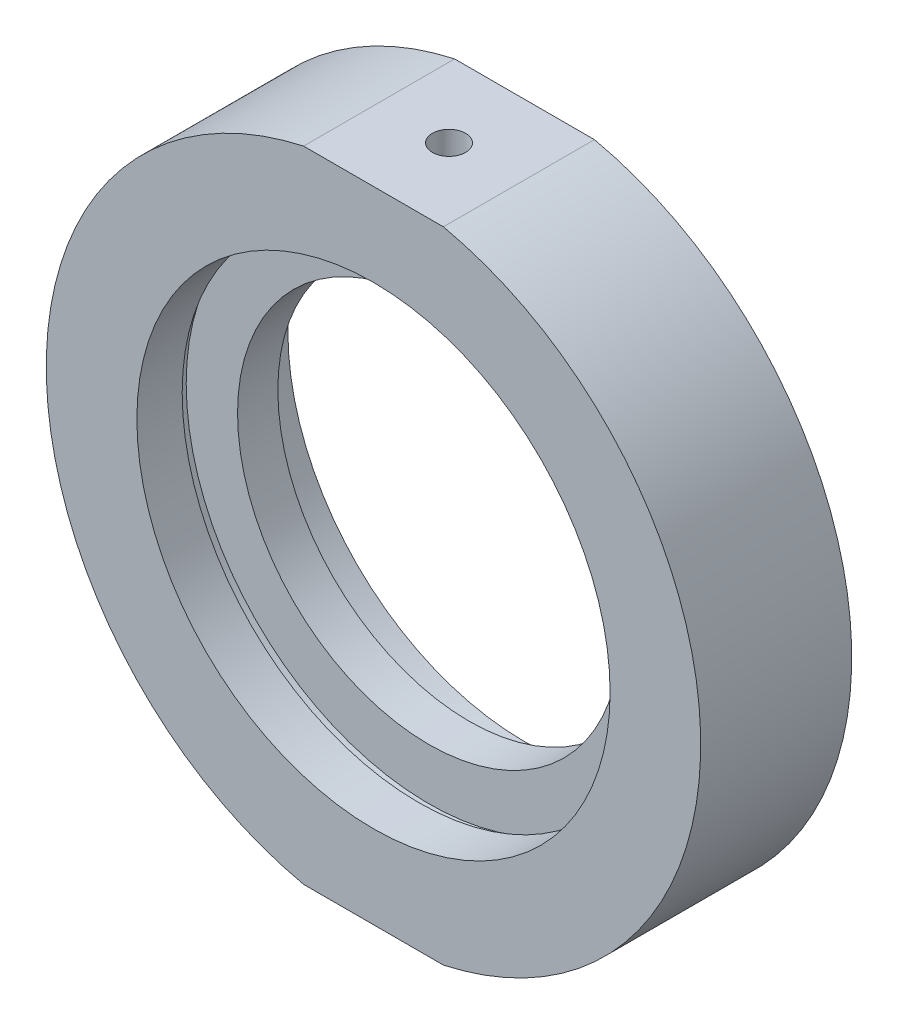
ISO-10303-21;
HEADER;
FILE_DESCRIPTION(('STEP AP214'),'2;1');
FILE_NAME('part.step','',(''),(''),'','','');
FILE_SCHEMA(('AUTOMOTIVE_DESIGN { 1 0 10303 214 1 1 1 1 }'));
ENDSEC;
DATA;
#1=APPLICATION_CONTEXT('core data for automotive mechanical design processes');
#2=APPLICATION_PROTOCOL_DEFINITION('international standard','automotive_design',2000,#1);
#3=PRODUCT_CONTEXT('',#1,'mechanical');
#4=PRODUCT('Part','Part','',(#3));
#5=PRODUCT_RELATED_PRODUCT_CATEGORY('part','',(#4));
#6=PRODUCT_DEFINITION_FORMATION('','',#4);
#7=PRODUCT_DEFINITION_CONTEXT('part definition',#1,'design');
#8=PRODUCT_DEFINITION('design','',#6,#7);
#9=PRODUCT_DEFINITION_SHAPE('','',#8);
#10=(LENGTH_UNIT() NAMED_UNIT(*) SI_UNIT(.MILLI.,.METRE.));
#11=(NAMED_UNIT(*) PLANE_ANGLE_UNIT() SI_UNIT($,.RADIAN.));
#12=(NAMED_UNIT(*) SI_UNIT($,.STERADIAN.) SOLID_ANGLE_UNIT());
#13=UNCERTAINTY_MEASURE_WITH_UNIT(LENGTH_MEASURE(1.E-05),#10,'distance_accuracy_value','');
#14=(GEOMETRIC_REPRESENTATION_CONTEXT(3) GLOBAL_UNCERTAINTY_ASSIGNED_CONTEXT((#13)) GLOBAL_UNIT_ASSIGNED_CONTEXT((#10,
#11,#12)) REPRESENTATION_CONTEXT('',''));
#15=CARTESIAN_POINT('',(0.,0.,0.));
#16=DIRECTION('',(0.,0.,1.));
#17=DIRECTION('',(1.,0.,0.));
#18=AXIS2_PLACEMENT_3D('',#15,#16,#17);
#19=CARTESIAN_POINT('',(0.,0.,-31.9390681003584));
#20=DIRECTION('',(0.,0.,-1.));
#21=DIRECTION('',(-1.,0.,0.));
#22=AXIS2_PLACEMENT_3D('',#19,#20,#21);
#23=CYLINDRICAL_SURFACE('',#22,32.5);
#24=CARTESIAN_POINT('',(0.,0.,7.50000000000001));
#25=DIRECTION('',(0.,0.,-1.));
#26=DIRECTION('',(-1.,0.,0.));
#27=AXIS2_PLACEMENT_3D('',#24,#25,#26);
#28=CIRCLE('',#27,32.5);
#29=CARTESIAN_POINT('',(6.94172168845742,31.75,7.5));
#30=VERTEX_POINT('',#29);
#31=CARTESIAN_POINT('',(6.94172168845742,-31.75,7.5));
#32=VERTEX_POINT('',#31);
#33=EDGE_CURVE('E153',#30,#32,#28,.T.);
#34=ORIENTED_EDGE('',*,*,#33,.T.);
#35=DIRECTION('',(0.,0.,-1.));
#36=VECTOR('',#35,1.);
#37=CARTESIAN_POINT('',(6.94172168845748,-31.75,-31.9390681003584));
#38=LINE('',#37,#36);
#39=CARTESIAN_POINT('',(6.94172168845745,-31.75,-7.5));
#40=VERTEX_POINT('',#39);
#41=EDGE_CURVE('E118',#32,#40,#38,.T.);
#42=ORIENTED_EDGE('',*,*,#41,.T.);
#43=CARTESIAN_POINT('',(0.,0.,-7.5));
#44=DIRECTION('',(0.,0.,-1.));
#45=DIRECTION('',(-1.,0.,0.));
#46=AXIS2_PLACEMENT_3D('',#43,#44,#45);
#47=CIRCLE('',#46,32.5);
#48=CARTESIAN_POINT('',(6.94172168845745,31.75,-7.5));
#49=VERTEX_POINT('',#48);
#50=EDGE_CURVE('E148',#49,#40,#47,.T.);
#51=ORIENTED_EDGE('',*,*,#50,.F.);
#52=DIRECTION('',(0.,0.,-1.));
#53=VECTOR('',#52,1.);
#54=CARTESIAN_POINT('',(6.94172168845748,31.75,-31.9390681003584));
#55=LINE('',#54,#53);
#56=EDGE_CURVE('E64',#49,#30,#55,.F.);
#57=ORIENTED_EDGE('',*,*,#56,.T.);
#58=EDGE_LOOP('',(#34,#42,#51,#57));
#59=FACE_BOUND('',#58,.T.);
#60=ADVANCED_FACE('F41',(#59),#23,.T.);
#61=CARTESIAN_POINT('',(19.,0.,-2.));
#62=DIRECTION('',(0.,0.,1.));
#63=DIRECTION('',(1.,0.,0.));
#64=AXIS2_PLACEMENT_3D('',#61,#62,#63);
#65=PLANE('',#64);
#66=CARTESIAN_POINT('',(0.,0.,-2.));
#67=DIRECTION('',(0.,0.,-1.));
#68=DIRECTION('',(-1.,0.,0.));
#69=AXIS2_PLACEMENT_3D('',#66,#67,#68);
#70=CIRCLE('',#69,19.);
#71=CARTESIAN_POINT('',(-19.,0.,-2.));
#72=VERTEX_POINT('',#71);
#73=EDGE_CURVE('E176',#72,#72,#70,.T.);
#74=ORIENTED_EDGE('',*,*,#73,.F.);
#75=EDGE_LOOP('',(#74));
#76=FACE_BOUND('',#75,.T.);
#77=CARTESIAN_POINT('',(0.,0.,-2.));
#78=DIRECTION('',(0.,0.,-1.));
#79=DIRECTION('',(-1.,0.,0.));
#80=AXIS2_PLACEMENT_3D('',#77,#78,#79);
#81=CIRCLE('',#80,24.1);
#82=CARTESIAN_POINT('',(-24.1,0.,-2.));
#83=VERTEX_POINT('',#82);
#84=EDGE_CURVE('E131',#83,#83,#81,.T.);
#85=ORIENTED_EDGE('',*,*,#84,.T.);
#86=EDGE_LOOP('',(#85));
#87=FACE_BOUND('',#86,.T.);
#88=ADVANCED_FACE('F43',(#76,#87),#65,.F.);
#89=CARTESIAN_POINT('',(0.,0.,-31.9390681003584));
#90=DIRECTION('',(0.,0.,-1.));
#91=DIRECTION('',(-1.,0.,0.));
#92=AXIS2_PLACEMENT_3D('',#89,#90,#91);
#93=CYLINDRICAL_SURFACE('',#92,19.);
#94=CARTESIAN_POINT('',(0.,0.,2.));
#95=DIRECTION('',(0.,0.,-1.));
#96=DIRECTION('',(-1.,0.,0.));
#97=AXIS2_PLACEMENT_3D('',#94,#95,#96);
#98=CIRCLE('',#97,19.);
#99=CARTESIAN_POINT('',(-19.,0.,2.));
#100=VERTEX_POINT('',#99);
#101=EDGE_CURVE('E172',#100,#100,#98,.T.);
#102=ORIENTED_EDGE('',*,*,#101,.F.);
#103=EDGE_LOOP('',(#102));
#104=FACE_BOUND('',#103,.T.);
#105=ORIENTED_EDGE('',*,*,#73,.T.);
#106=EDGE_LOOP('',(#105));
#107=FACE_BOUND('',#106,.T.);
#108=ADVANCED_FACE('F219',(#104,#107),#93,.F.);
#109=CARTESIAN_POINT('',(24.1,0.,2.));
#110=DIRECTION('',(0.,0.,-1.));
#111=DIRECTION('',(-1.,0.,0.));
#112=AXIS2_PLACEMENT_3D('',#109,#110,#111);
#113=PLANE('',#112);
#114=CARTESIAN_POINT('',(0.,0.,1.99999999999999));
#115=DIRECTION('',(0.,0.,-1.));
#116=DIRECTION('',(-1.,0.,0.));
#117=AXIS2_PLACEMENT_3D('',#114,#115,#116);
#118=CIRCLE('',#117,24.1);
#119=CARTESIAN_POINT('',(-24.1,0.,2.));
#120=VERTEX_POINT('',#119);
#121=EDGE_CURVE('E168',#120,#120,#118,.T.);
#122=ORIENTED_EDGE('',*,*,#121,.F.);
#123=EDGE_LOOP('',(#122));
#124=FACE_BOUND('',#123,.T.);
#125=ORIENTED_EDGE('',*,*,#101,.T.);
#126=EDGE_LOOP('',(#125));
#127=FACE_BOUND('',#126,.T.);
#128=ADVANCED_FACE('F244',(#124,#127),#113,.F.);
#129=CARTESIAN_POINT('',(0.,0.,-31.9390681003584));
#130=DIRECTION('',(0.,0.,-1.));
#131=DIRECTION('',(-1.,0.,0.));
#132=AXIS2_PLACEMENT_3D('',#129,#130,#131);
#133=CYLINDRICAL_SURFACE('',#132,24.1);
#134=CARTESIAN_POINT('',(0.,0.,3.));
#135=DIRECTION('',(0.,0.,-1.));
#136=DIRECTION('',(-1.,0.,0.));
#137=AXIS2_PLACEMENT_3D('',#134,#135,#136);
#138=CIRCLE('',#137,24.1);
#139=CARTESIAN_POINT('',(-24.1,0.,3.));
#140=VERTEX_POINT('',#139);
#141=EDGE_CURVE('E165',#140,#140,#138,.T.);
#142=ORIENTED_EDGE('',*,*,#141,.F.);
#143=EDGE_LOOP('',(#142));
#144=FACE_BOUND('',#143,.T.);
#145=ORIENTED_EDGE('',*,*,#121,.T.);
#146=EDGE_LOOP('',(#145));
#147=FACE_BOUND('',#146,.T.);
#148=ADVANCED_FACE('F240',(#144,#147),#133,.F.);
#149=CARTESIAN_POINT('',(24.1,0.,3.));
#150=DIRECTION('',(0.,0.,1.));
#151=DIRECTION('',(1.,0.,0.));
#152=AXIS2_PLACEMENT_3D('',#149,#150,#151);
#153=PLANE('',#152);
#154=CARTESIAN_POINT('',(0.,0.,3.));
#155=DIRECTION('',(0.,0.,-1.));
#156=DIRECTION('',(-1.,0.,0.));
#157=AXIS2_PLACEMENT_3D('',#154,#155,#156);
#158=CIRCLE('',#157,23.5);
#159=CARTESIAN_POINT('',(-23.5,0.,3.));
#160=VERTEX_POINT('',#159);
#161=EDGE_CURVE('E161',#160,#160,#158,.T.);
#162=ORIENTED_EDGE('',*,*,#161,.F.);
#163=EDGE_LOOP('',(#162));
#164=FACE_BOUND('',#163,.T.);
#165=ORIENTED_EDGE('',*,*,#141,.T.);
#166=EDGE_LOOP('',(#165));
#167=FACE_BOUND('',#166,.T.);
#168=ADVANCED_FACE('F234',(#164,#167),#153,.F.);
#169=CARTESIAN_POINT('',(0.,0.,-31.9390681003584));
#170=DIRECTION('',(0.,0.,-1.));
#171=DIRECTION('',(-1.,0.,0.));
#172=AXIS2_PLACEMENT_3D('',#169,#170,#171);
#173=CYLINDRICAL_SURFACE('',#172,23.5);
#174=CARTESIAN_POINT('',(0.,0.,7.5));
#175=DIRECTION('',(0.,0.,-1.));
#176=DIRECTION('',(-1.,0.,0.));
#177=AXIS2_PLACEMENT_3D('',#174,#175,#176);
#178=CIRCLE('',#177,23.5);
#179=CARTESIAN_POINT('',(-23.5,0.,7.5));
#180=VERTEX_POINT('',#179);
#181=EDGE_CURVE('E157',#180,#180,#178,.T.);
#182=ORIENTED_EDGE('',*,*,#181,.F.);
#183=EDGE_LOOP('',(#182));
#184=FACE_BOUND('',#183,.T.);
#185=ORIENTED_EDGE('',*,*,#161,.T.);
#186=EDGE_LOOP('',(#185));
#187=FACE_BOUND('',#186,.T.);
#188=ADVANCED_FACE('F230',(#184,#187),#173,.F.);
#189=CARTESIAN_POINT('',(32.5,0.,7.5));
#190=DIRECTION('',(0.,0.,-1.));
#191=DIRECTION('',(-1.,0.,0.));
#192=AXIS2_PLACEMENT_3D('',#189,#190,#191);
#193=PLANE('',#192);
#194=CARTESIAN_POINT('',(-6.94172168845741,-31.75,7.5));
#195=VERTEX_POINT('',#194);
#196=CARTESIAN_POINT('',(-6.94172168845741,31.75,7.5));
#197=VERTEX_POINT('',#196);
#198=EDGE_CURVE('E152',#195,#197,#28,.T.);
#199=ORIENTED_EDGE('',*,*,#198,.F.);
#200=DIRECTION('',(-1.,0.,0.));
#201=VECTOR('',#200,1.);
#202=CARTESIAN_POINT('',(-33.1519726534682,-31.75,7.5));
#203=LINE('',#202,#201);
#204=EDGE_CURVE('E114',#32,#195,#203,.T.);
#205=ORIENTED_EDGE('',*,*,#204,.F.);
#206=ORIENTED_EDGE('',*,*,#33,.F.);
#207=DIRECTION('',(1.,0.,0.));
#208=VECTOR('',#207,1.);
#209=CARTESIAN_POINT('',(-33.1519726534682,31.75,7.5));
#210=LINE('',#209,#208);
#211=EDGE_CURVE('E122',#197,#30,#210,.T.);
#212=ORIENTED_EDGE('',*,*,#211,.F.);
#213=EDGE_LOOP('',(#199,#205,#206,#212));
#214=FACE_BOUND('',#213,.T.);
#215=ORIENTED_EDGE('',*,*,#181,.T.);
#216=EDGE_LOOP('',(#215));
#217=FACE_BOUND('',#216,.T.);
#218=ADVANCED_FACE('F192',(#214,#217),#193,.F.);
#219=CARTESIAN_POINT('',(-6.94172168845744,-31.75,-7.5));
#220=VERTEX_POINT('',#219);
#221=CARTESIAN_POINT('',(-6.94172168845744,31.75,-7.5));
#222=VERTEX_POINT('',#221);
#223=EDGE_CURVE('E147',#220,#222,#47,.T.);
#224=ORIENTED_EDGE('',*,*,#223,.F.);
#225=DIRECTION('',(0.,0.,-1.));
#226=VECTOR('',#225,1.);
#227=CARTESIAN_POINT('',(-6.94172168845748,-31.75,-31.9390681003584));
#228=LINE('',#227,#226);
#229=EDGE_CURVE('E57',#220,#195,#228,.F.);
#230=ORIENTED_EDGE('',*,*,#229,.T.);
#231=ORIENTED_EDGE('',*,*,#198,.T.);
#232=DIRECTION('',(0.,0.,-1.));
#233=VECTOR('',#232,1.);
#234=CARTESIAN_POINT('',(-6.94172168845748,31.75,-31.9390681003584));
#235=LINE('',#234,#233);
#236=EDGE_CURVE('E127',#197,#222,#235,.T.);
#237=ORIENTED_EDGE('',*,*,#236,.T.);
#238=EDGE_LOOP('',(#224,#230,#231,#237));
#239=FACE_BOUND('',#238,.T.);
#240=ADVANCED_FACE('F197',(#239),#23,.T.);
#241=CARTESIAN_POINT('',(23.5,0.,-7.5));
#242=DIRECTION('',(0.,0.,1.));
#243=DIRECTION('',(1.,0.,0.));
#244=AXIS2_PLACEMENT_3D('',#241,#242,#243);
#245=PLANE('',#244);
#246=CARTESIAN_POINT('',(0.,0.,-7.5));
#247=DIRECTION('',(0.,0.,-1.));
#248=DIRECTION('',(-1.,0.,0.));
#249=AXIS2_PLACEMENT_3D('',#246,#247,#248);
#250=CIRCLE('',#249,23.5);
#251=CARTESIAN_POINT('',(-23.5,0.,-7.5));
#252=VERTEX_POINT('',#251);
#253=EDGE_CURVE('E143',#252,#252,#250,.T.);
#254=ORIENTED_EDGE('',*,*,#253,.F.);
#255=EDGE_LOOP('',(#254));
#256=FACE_BOUND('',#255,.T.);
#257=ORIENTED_EDGE('',*,*,#50,.T.);
#258=DIRECTION('',(-1.,0.,0.));
#259=VECTOR('',#258,1.);
#260=CARTESIAN_POINT('',(23.5,-31.75,-7.5));
#261=LINE('',#260,#259);
#262=EDGE_CURVE('E11',#40,#220,#261,.T.);
#263=ORIENTED_EDGE('',*,*,#262,.T.);
#264=ORIENTED_EDGE('',*,*,#223,.T.);
#265=DIRECTION('',(1.,0.,0.));
#266=VECTOR('',#265,1.);
#267=CARTESIAN_POINT('',(23.5,31.75,-7.5));
#268=LINE('',#267,#266);
#269=EDGE_CURVE('E50',#222,#49,#268,.T.);
#270=ORIENTED_EDGE('',*,*,#269,.T.);
#271=EDGE_LOOP('',(#257,#263,#264,#270));
#272=FACE_BOUND('',#271,.T.);
#273=ADVANCED_FACE('F183',(#256,#272),#245,.F.);
#274=CARTESIAN_POINT('',(0.,0.,-31.9390681003584));
#275=DIRECTION('',(0.,0.,-1.));
#276=DIRECTION('',(-1.,0.,0.));
#277=AXIS2_PLACEMENT_3D('',#274,#275,#276);
#278=CYLINDRICAL_SURFACE('',#277,23.5);
#279=CARTESIAN_POINT('',(0.,0.,-3.));
#280=DIRECTION('',(0.,0.,-1.));
#281=DIRECTION('',(-1.,0.,0.));
#282=AXIS2_PLACEMENT_3D('',#279,#280,#281);
#283=CIRCLE('',#282,23.5);
#284=CARTESIAN_POINT('',(-23.5,0.,-3.));
#285=VERTEX_POINT('',#284);
#286=EDGE_CURVE('E139',#285,#285,#283,.T.);
#287=ORIENTED_EDGE('',*,*,#286,.F.);
#288=EDGE_LOOP('',(#287));
#289=FACE_BOUND('',#288,.T.);
#290=ORIENTED_EDGE('',*,*,#253,.T.);
#291=EDGE_LOOP('',(#290));
#292=FACE_BOUND('',#291,.T.);
#293=ADVANCED_FACE('F228',(#289,#292),#278,.F.);
#294=CARTESIAN_POINT('',(24.1,0.,-3.));
#295=DIRECTION('',(0.,0.,-1.));
#296=DIRECTION('',(-1.,0.,0.));
#297=AXIS2_PLACEMENT_3D('',#294,#295,#296);
#298=PLANE('',#297);
#299=CARTESIAN_POINT('',(0.,0.,-3.));
#300=DIRECTION('',(0.,0.,-1.));
#301=DIRECTION('',(-1.,0.,0.));
#302=AXIS2_PLACEMENT_3D('',#299,#300,#301);
#303=CIRCLE('',#302,24.1);
#304=CARTESIAN_POINT('',(-24.1,0.,-3.));
#305=VERTEX_POINT('',#304);
#306=EDGE_CURVE('E135',#305,#305,#303,.T.);
#307=ORIENTED_EDGE('',*,*,#306,.F.);
#308=EDGE_LOOP('',(#307));
#309=FACE_BOUND('',#308,.T.);
#310=ORIENTED_EDGE('',*,*,#286,.T.);
#311=EDGE_LOOP('',(#310));
#312=FACE_BOUND('',#311,.T.);
#313=ADVANCED_FACE('F210',(#309,#312),#298,.F.);
#314=CARTESIAN_POINT('',(0.,0.,-31.9390681003584));
#315=DIRECTION('',(0.,0.,-1.));
#316=DIRECTION('',(-1.,0.,0.));
#317=AXIS2_PLACEMENT_3D('',#314,#315,#316);
#318=CYLINDRICAL_SURFACE('',#317,24.1);
#319=ORIENTED_EDGE('',*,*,#84,.F.);
#320=EDGE_LOOP('',(#319));
#321=FACE_BOUND('',#320,.T.);
#322=ORIENTED_EDGE('',*,*,#306,.T.);
#323=EDGE_LOOP('',(#322));
#324=FACE_BOUND('',#323,.T.);
#325=ADVANCED_FACE('F200',(#321,#324),#318,.F.);
#326=CARTESIAN_POINT('',(-33.1519726534682,31.75,-41.5));
#327=DIRECTION('',(0.,-1.,0.));
#328=DIRECTION('',(0.,0.,-1.));
#329=AXIS2_PLACEMENT_3D('',#326,#327,#328);
#330=PLANE('',#329);
#331=CARTESIAN_POINT('',(0.,31.75,0.));
#332=DIRECTION('',(0.,1.,0.));
#333=DIRECTION('',(0.,0.,1.));
#334=AXIS2_PLACEMENT_3D('',#331,#332,#333);
#335=CIRCLE('',#334,1.64999999999999);
#336=CARTESIAN_POINT('',(0.,31.75,1.64999999999999));
#337=VERTEX_POINT('',#336);
#338=EDGE_CURVE('E98',#337,#337,#335,.T.);
#339=ORIENTED_EDGE('',*,*,#338,.F.);
#340=EDGE_LOOP('',(#339));
#341=FACE_BOUND('',#340,.T.);
#342=ORIENTED_EDGE('',*,*,#211,.T.);
#343=ORIENTED_EDGE('',*,*,#56,.F.);
#344=ORIENTED_EDGE('',*,*,#269,.F.);
#345=ORIENTED_EDGE('',*,*,#236,.F.);
#346=EDGE_LOOP('',(#342,#343,#344,#345));
#347=FACE_BOUND('',#346,.T.);
#348=ADVANCED_FACE('F198',(#341,#347),#330,.F.);
#349=CARTESIAN_POINT('',(-33.1519726534682,-31.75,-41.5));
#350=DIRECTION('',(0.,1.,0.));
#351=DIRECTION('',(0.,0.,1.));
#352=AXIS2_PLACEMENT_3D('',#349,#350,#351);
#353=PLANE('',#352);
#354=CARTESIAN_POINT('',(0.,-31.75,0.));
#355=DIRECTION('',(0.,-1.,0.));
#356=DIRECTION('',(0.,0.,-1.));
#357=AXIS2_PLACEMENT_3D('',#354,#355,#356);
#358=CIRCLE('',#357,2.5);
#359=CARTESIAN_POINT('',(0.,-31.75,-2.5));
#360=VERTEX_POINT('',#359);
#361=EDGE_CURVE('E99',#360,#360,#358,.T.);
#362=ORIENTED_EDGE('',*,*,#361,.F.);
#363=EDGE_LOOP('',(#362));
#364=FACE_BOUND('',#363,.T.);
#365=ORIENTED_EDGE('',*,*,#204,.T.);
#366=ORIENTED_EDGE('',*,*,#229,.F.);
#367=ORIENTED_EDGE('',*,*,#262,.F.);
#368=ORIENTED_EDGE('',*,*,#41,.F.);
#369=EDGE_LOOP('',(#365,#366,#367,#368));
#370=FACE_BOUND('',#369,.T.);
#371=ADVANCED_FACE('F189',(#364,#370),#353,.F.);
#372=CARTESIAN_POINT('',(0.,26.25,0.));
#373=DIRECTION('',(0.,1.,0.));
#374=DIRECTION('',(0.,0.,1.));
#375=AXIS2_PLACEMENT_3D('',#372,#373,#374);
#376=CONICAL_SURFACE('',#375,1.65,1.02974425867665);
#377=CARTESIAN_POINT('',(0.,25.2585799786045,0.));
#378=VERTEX_POINT('',#377);
#379=VERTEX_LOOP('',#378);
#380=FACE_BOUND('',#379,.T.);
#381=CARTESIAN_POINT('',(0.,26.25,0.));
#382=DIRECTION('',(0.,1.,0.));
#383=DIRECTION('',(0.,0.,1.));
#384=AXIS2_PLACEMENT_3D('',#381,#382,#383);
#385=CIRCLE('',#384,1.65);
#386=CARTESIAN_POINT('',(0.,26.25,1.65));
#387=VERTEX_POINT('',#386);
#388=EDGE_CURVE('E105',#387,#387,#385,.T.);
#389=ORIENTED_EDGE('',*,*,#388,.T.);
#390=EDGE_LOOP('',(#389));
#391=FACE_BOUND('',#390,.T.);
#392=ADVANCED_FACE('F207',(#380,#391),#376,.F.);
#393=CARTESIAN_POINT('',(0.,31.75,0.));
#394=DIRECTION('',(0.,1.,0.));
#395=DIRECTION('',(0.,0.,1.));
#396=AXIS2_PLACEMENT_3D('',#393,#394,#395);
#397=CYLINDRICAL_SURFACE('',#396,1.64999999999999);
#398=ORIENTED_EDGE('',*,*,#388,.F.);
#399=EDGE_LOOP('',(#398));
#400=FACE_BOUND('',#399,.T.);
#401=ORIENTED_EDGE('',*,*,#338,.T.);
#402=EDGE_LOOP('',(#401));
#403=FACE_BOUND('',#402,.T.);
#404=ADVANCED_FACE('F91',(#400,#403),#397,.F.);
#405=CARTESIAN_POINT('',(0.,-26.25,0.));
#406=DIRECTION('',(0.,-1.,0.));
#407=DIRECTION('',(0.,0.,-1.));
#408=AXIS2_PLACEMENT_3D('',#405,#406,#407);
#409=CONICAL_SURFACE('',#408,2.5,1.02974425867665);
#410=CARTESIAN_POINT('',(0.,-24.7478484524311,0.));
#411=VERTEX_POINT('',#410);
#412=VERTEX_LOOP('',#411);
#413=FACE_BOUND('',#412,.T.);
#414=CARTESIAN_POINT('',(0.,-26.25,0.));
#415=DIRECTION('',(0.,-1.,0.));
#416=DIRECTION('',(0.,0.,-1.));
#417=AXIS2_PLACEMENT_3D('',#414,#415,#416);
#418=CIRCLE('',#417,2.5);
#419=CARTESIAN_POINT('',(0.,-26.25,-2.5));
#420=VERTEX_POINT('',#419);
#421=EDGE_CURVE('E95',#420,#420,#418,.T.);
#422=ORIENTED_EDGE('',*,*,#421,.T.);
#423=EDGE_LOOP('',(#422));
#424=FACE_BOUND('',#423,.T.);
#425=ADVANCED_FACE('F87',(#413,#424),#409,.F.);
#426=CARTESIAN_POINT('',(0.,-31.75,0.));
#427=DIRECTION('',(0.,-1.,0.));
#428=DIRECTION('',(0.,0.,-1.));
#429=AXIS2_PLACEMENT_3D('',#426,#427,#428);
#430=CYLINDRICAL_SURFACE('',#429,2.5);
#431=ORIENTED_EDGE('',*,*,#421,.F.);
#432=EDGE_LOOP('',(#431));
#433=FACE_BOUND('',#432,.T.);
#434=ORIENTED_EDGE('',*,*,#361,.T.);
#435=EDGE_LOOP('',(#434));
#436=FACE_BOUND('',#435,.T.);
#437=ADVANCED_FACE('F90',(#433,#436),#430,.F.);
#438=CLOSED_SHELL('',(#60,#88,#108,#128,#148,#168,#188,#218,#240,#273,#293,#313,#325,#348,#371,
#392,#404,#425,#437));
#439=MANIFOLD_SOLID_BREP('B2',#438);
#440=ADVANCED_BREP_SHAPE_REPRESENTATION('',(#18,#439),#14);
#441=SHAPE_DEFINITION_REPRESENTATION(#9,#440);
ENDSEC;
END-ISO-10303-21;
